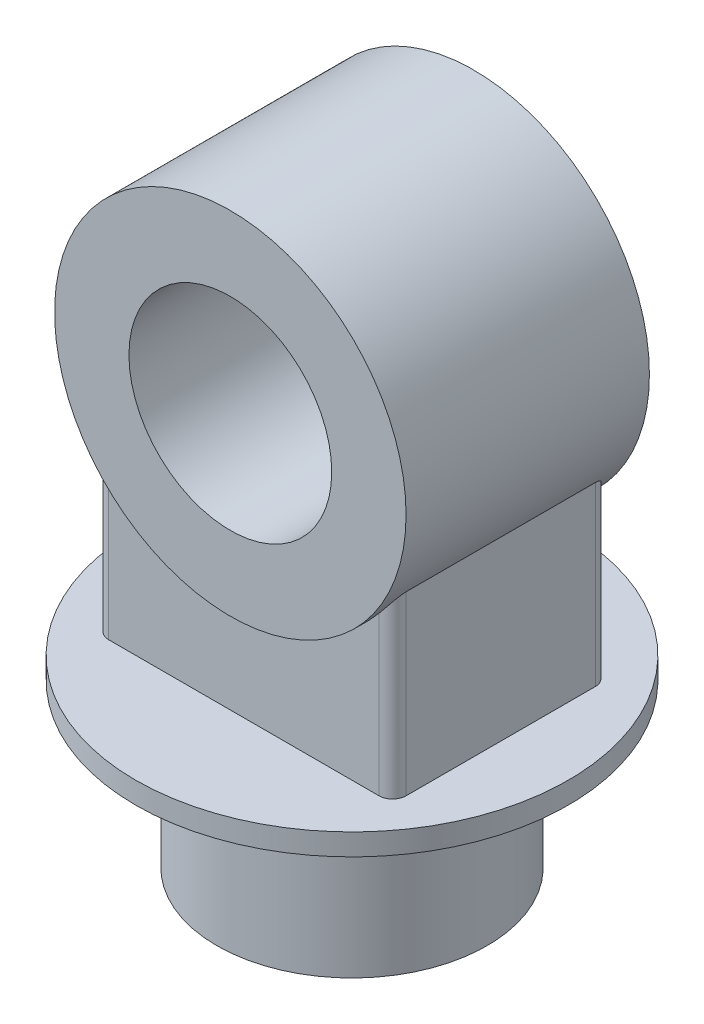
ISO-10303-21;
HEADER;
FILE_DESCRIPTION(('STEP AP214'),'2;1');
FILE_NAME('part.step','',(''),(''),'','','');
FILE_SCHEMA(('AUTOMOTIVE_DESIGN { 1 0 10303 214 1 1 1 1 }'));
ENDSEC;
DATA;
#1=APPLICATION_CONTEXT('core data for automotive mechanical design processes');
#2=APPLICATION_PROTOCOL_DEFINITION('international standard','automotive_design',2000,#1);
#3=PRODUCT_CONTEXT('',#1,'mechanical');
#4=PRODUCT('Part','Part','',(#3));
#5=PRODUCT_RELATED_PRODUCT_CATEGORY('part','',(#4));
#6=PRODUCT_DEFINITION_FORMATION('','',#4);
#7=PRODUCT_DEFINITION_CONTEXT('part definition',#1,'design');
#8=PRODUCT_DEFINITION('design','',#6,#7);
#9=PRODUCT_DEFINITION_SHAPE('','',#8);
#10=(LENGTH_UNIT() NAMED_UNIT(*) SI_UNIT(.MILLI.,.METRE.));
#11=(NAMED_UNIT(*) PLANE_ANGLE_UNIT() SI_UNIT($,.RADIAN.));
#12=(NAMED_UNIT(*) SI_UNIT($,.STERADIAN.) SOLID_ANGLE_UNIT());
#13=UNCERTAINTY_MEASURE_WITH_UNIT(LENGTH_MEASURE(1.E-05),#10,'distance_accuracy_value','');
#14=(GEOMETRIC_REPRESENTATION_CONTEXT(3) GLOBAL_UNCERTAINTY_ASSIGNED_CONTEXT((#13)) GLOBAL_UNIT_ASSIGNED_CONTEXT((#10,
#11,#12)) REPRESENTATION_CONTEXT('',''));
#15=CARTESIAN_POINT('',(0.,0.,0.));
#16=DIRECTION('',(0.,0.,1.));
#17=DIRECTION('',(1.,0.,0.));
#18=AXIS2_PLACEMENT_3D('',#15,#16,#17);
#19=CARTESIAN_POINT('',(0.,120.,0.));
#20=DIRECTION('',(0.,-1.,0.));
#21=DIRECTION('',(0.,0.,-1.));
#22=AXIS2_PLACEMENT_3D('',#19,#20,#21);
#23=CYLINDRICAL_SURFACE('',#22,100.);
#24=CARTESIAN_POINT('',(0.,120.,0.));
#25=DIRECTION('',(0.,1.,0.));
#26=DIRECTION('',(0.,0.,1.));
#27=AXIS2_PLACEMENT_3D('',#24,#25,#26);
#28=CIRCLE('',#27,100.);
#29=CARTESIAN_POINT('',(0.,120.,100.));
#30=VERTEX_POINT('',#29);
#31=EDGE_CURVE('E140',#30,#30,#28,.T.);
#32=ORIENTED_EDGE('',*,*,#31,.F.);
#33=EDGE_LOOP('',(#32));
#34=FACE_BOUND('',#33,.T.);
#35=CARTESIAN_POINT('',(0.,0.,0.));
#36=DIRECTION('',(0.,1.,0.));
#37=DIRECTION('',(0.,0.,1.));
#38=AXIS2_PLACEMENT_3D('',#35,#36,#37);
#39=CIRCLE('',#38,100.);
#40=CARTESIAN_POINT('',(0.,0.,100.));
#41=VERTEX_POINT('',#40);
#42=EDGE_CURVE('E214',#41,#41,#39,.T.);
#43=ORIENTED_EDGE('',*,*,#42,.T.);
#44=EDGE_LOOP('',(#43));
#45=FACE_BOUND('',#44,.T.);
#46=ADVANCED_FACE('F40',(#34,#45),#23,.T.);
#47=CARTESIAN_POINT('',(0.,0.,0.));
#48=DIRECTION('',(0.,1.,0.));
#49=DIRECTION('',(0.,0.,1.));
#50=AXIS2_PLACEMENT_3D('',#47,#48,#49);
#51=PLANE('',#50);
#52=ORIENTED_EDGE('',*,*,#42,.F.);
#53=EDGE_LOOP('',(#52));
#54=FACE_BOUND('',#53,.T.);
#55=ADVANCED_FACE('F223',(#54),#51,.F.);
#56=CARTESIAN_POINT('',(0.,136.,0.));
#57=DIRECTION('',(0.,-1.,0.));
#58=DIRECTION('',(0.,0.,-1.));
#59=AXIS2_PLACEMENT_3D('',#56,#57,#58);
#60=CYLINDRICAL_SURFACE('',#59,160.);
#61=CARTESIAN_POINT('',(0.,136.,0.));
#62=DIRECTION('',(0.,1.,0.));
#63=DIRECTION('',(0.,0.,1.));
#64=AXIS2_PLACEMENT_3D('',#61,#62,#63);
#65=CIRCLE('',#64,160.);
#66=CARTESIAN_POINT('',(0.,136.,160.));
#67=VERTEX_POINT('',#66);
#68=EDGE_CURVE('E211',#67,#67,#65,.T.);
#69=ORIENTED_EDGE('',*,*,#68,.F.);
#70=EDGE_LOOP('',(#69));
#71=FACE_BOUND('',#70,.T.);
#72=CARTESIAN_POINT('',(0.,120.,0.));
#73=DIRECTION('',(0.,1.,0.));
#74=DIRECTION('',(0.,0.,1.));
#75=AXIS2_PLACEMENT_3D('',#72,#73,#74);
#76=CIRCLE('',#75,160.);
#77=CARTESIAN_POINT('',(0.,120.,160.));
#78=VERTEX_POINT('',#77);
#79=EDGE_CURVE('E215',#78,#78,#76,.T.);
#80=ORIENTED_EDGE('',*,*,#79,.T.);
#81=EDGE_LOOP('',(#80));
#82=FACE_BOUND('',#81,.T.);
#83=ADVANCED_FACE('F225',(#71,#82),#60,.T.);
#84=CARTESIAN_POINT('',(0.,136.,0.));
#85=DIRECTION('',(0.,1.,0.));
#86=DIRECTION('',(0.,0.,1.));
#87=AXIS2_PLACEMENT_3D('',#84,#85,#86);
#88=PLANE('',#87);
#89=DIRECTION('',(0.,0.,-1.));
#90=VECTOR('',#89,1.);
#91=CARTESIAN_POINT('',(110.,136.,-80.));
#92=LINE('',#91,#90);
#93=CARTESIAN_POINT('',(110.,136.,70.));
#94=VERTEX_POINT('',#93);
#95=CARTESIAN_POINT('',(110.,136.,-70.));
#96=VERTEX_POINT('',#95);
#97=EDGE_CURVE('E191',#94,#96,#92,.T.);
#98=ORIENTED_EDGE('',*,*,#97,.F.);
#99=CARTESIAN_POINT('',(100.,136.,70.));
#100=DIRECTION('',(0.,1.,0.));
#101=DIRECTION('',(0.,0.,1.));
#102=AXIS2_PLACEMENT_3D('',#99,#100,#101);
#103=CIRCLE('',#102,10.);
#104=CARTESIAN_POINT('',(100.,136.,80.));
#105=VERTEX_POINT('',#104);
#106=EDGE_CURVE('E54',#94,#105,#103,.F.);
#107=ORIENTED_EDGE('',*,*,#106,.T.);
#108=DIRECTION('',(1.,0.,0.));
#109=VECTOR('',#108,1.);
#110=CARTESIAN_POINT('',(-110.,136.,80.));
#111=LINE('',#110,#109);
#112=CARTESIAN_POINT('',(-100.,136.,80.));
#113=VERTEX_POINT('',#112);
#114=EDGE_CURVE('E190',#113,#105,#111,.T.);
#115=ORIENTED_EDGE('',*,*,#114,.F.);
#116=CARTESIAN_POINT('',(-100.,136.,70.));
#117=DIRECTION('',(0.,1.,0.));
#118=DIRECTION('',(0.,0.,1.));
#119=AXIS2_PLACEMENT_3D('',#116,#117,#118);
#120=CIRCLE('',#119,10.);
#121=CARTESIAN_POINT('',(-110.,136.,70.));
#122=VERTEX_POINT('',#121);
#123=EDGE_CURVE('E123',#113,#122,#120,.F.);
#124=ORIENTED_EDGE('',*,*,#123,.T.);
#125=DIRECTION('',(0.,0.,1.));
#126=VECTOR('',#125,1.);
#127=CARTESIAN_POINT('',(-110.,136.,-80.));
#128=LINE('',#127,#126);
#129=CARTESIAN_POINT('',(-110.,136.,-70.));
#130=VERTEX_POINT('',#129);
#131=EDGE_CURVE('E192',#130,#122,#128,.T.);
#132=ORIENTED_EDGE('',*,*,#131,.F.);
#133=CARTESIAN_POINT('',(-100.,136.,-70.));
#134=DIRECTION('',(0.,1.,0.));
#135=DIRECTION('',(0.,0.,1.));
#136=AXIS2_PLACEMENT_3D('',#133,#134,#135);
#137=CIRCLE('',#136,10.);
#138=CARTESIAN_POINT('',(-100.,136.,-80.));
#139=VERTEX_POINT('',#138);
#140=EDGE_CURVE('E122',#130,#139,#137,.F.);
#141=ORIENTED_EDGE('',*,*,#140,.T.);
#142=DIRECTION('',(-1.,0.,0.));
#143=VECTOR('',#142,1.);
#144=CARTESIAN_POINT('',(-110.,136.,-80.));
#145=LINE('',#144,#143);
#146=CARTESIAN_POINT('',(100.,136.,-80.));
#147=VERTEX_POINT('',#146);
#148=EDGE_CURVE('E201',#147,#139,#145,.T.);
#149=ORIENTED_EDGE('',*,*,#148,.F.);
#150=CARTESIAN_POINT('',(100.,136.,-70.));
#151=DIRECTION('',(0.,1.,0.));
#152=DIRECTION('',(0.,0.,1.));
#153=AXIS2_PLACEMENT_3D('',#150,#151,#152);
#154=CIRCLE('',#153,10.);
#155=EDGE_CURVE('E61',#147,#96,#154,.F.);
#156=ORIENTED_EDGE('',*,*,#155,.T.);
#157=EDGE_LOOP('',(#98,#107,#115,#124,#132,#141,#149,#156));
#158=FACE_BOUND('',#157,.T.);
#159=ORIENTED_EDGE('',*,*,#68,.T.);
#160=EDGE_LOOP('',(#159));
#161=FACE_BOUND('',#160,.T.);
#162=ADVANCED_FACE('F188',(#158,#161),#88,.T.);
#163=CARTESIAN_POINT('',(0.,120.,0.));
#164=DIRECTION('',(0.,1.,0.));
#165=DIRECTION('',(0.,0.,1.));
#166=AXIS2_PLACEMENT_3D('',#163,#164,#165);
#167=PLANE('',#166);
#168=ORIENTED_EDGE('',*,*,#31,.T.);
#169=EDGE_LOOP('',(#168));
#170=FACE_BOUND('',#169,.T.);
#171=ORIENTED_EDGE('',*,*,#79,.F.);
#172=EDGE_LOOP('',(#171));
#173=FACE_BOUND('',#172,.T.);
#174=ADVANCED_FACE('F234',(#170,#173),#167,.F.);
#175=CARTESIAN_POINT('',(-110.,466.002,-80.));
#176=DIRECTION('',(0.,0.,1.));
#177=DIRECTION('',(1.,0.,0.));
#178=AXIS2_PLACEMENT_3D('',#175,#176,#177);
#179=PLANE('',#178);
#180=ORIENTED_EDGE('',*,*,#148,.T.);
#181=DIRECTION('',(0.,-1.,0.));
#182=VECTOR('',#181,1.);
#183=CARTESIAN_POINT('',(-100.,466.002,-80.));
#184=LINE('',#183,#182);
#185=CARTESIAN_POINT('',(-100.,252.933761370819,-80.));
#186=VERTEX_POINT('',#185);
#187=EDGE_CURVE('E148',#139,#186,#184,.F.);
#188=ORIENTED_EDGE('',*,*,#187,.T.);
#189=CARTESIAN_POINT('',(0.,336.,-80.));
#190=DIRECTION('',(0.,0.,1.));
#191=DIRECTION('',(1.,0.,0.));
#192=AXIS2_PLACEMENT_3D('',#189,#190,#191);
#193=CIRCLE('',#192,130.);
#194=CARTESIAN_POINT('',(100.,252.933761370819,-80.));
#195=VERTEX_POINT('',#194);
#196=EDGE_CURVE('E202',#195,#186,#193,.F.);
#197=ORIENTED_EDGE('',*,*,#196,.F.);
#198=DIRECTION('',(0.,-1.,0.));
#199=VECTOR('',#198,1.);
#200=CARTESIAN_POINT('',(100.,466.002,-80.));
#201=LINE('',#200,#199);
#202=EDGE_CURVE('E145',#195,#147,#201,.T.);
#203=ORIENTED_EDGE('',*,*,#202,.T.);
#204=EDGE_LOOP('',(#180,#188,#197,#203));
#205=FACE_BOUND('',#204,.T.);
#206=ADVANCED_FACE('F237',(#205),#179,.F.);
#207=CARTESIAN_POINT('',(110.,466.002,-80.));
#208=DIRECTION('',(-1.,0.,0.));
#209=DIRECTION('',(0.,0.,1.));
#210=AXIS2_PLACEMENT_3D('',#207,#208,#209);
#211=PLANE('',#210);
#212=ORIENTED_EDGE('',*,*,#97,.T.);
#213=DIRECTION('',(0.,-1.,0.));
#214=VECTOR('',#213,1.);
#215=CARTESIAN_POINT('',(110.,466.002,-70.));
#216=LINE('',#215,#214);
#217=CARTESIAN_POINT('',(110.,266.717967697245,-69.9999999999999));
#218=VERTEX_POINT('',#217);
#219=EDGE_CURVE('E152',#96,#218,#216,.F.);
#220=ORIENTED_EDGE('',*,*,#219,.T.);
#221=DIRECTION('',(0.,0.,-1.));
#222=VECTOR('',#221,1.);
#223=CARTESIAN_POINT('',(110.,266.717967697245,90.));
#224=LINE('',#223,#222);
#225=CARTESIAN_POINT('',(110.,266.717967697245,70.));
#226=VERTEX_POINT('',#225);
#227=EDGE_CURVE('E196',#226,#218,#224,.T.);
#228=ORIENTED_EDGE('',*,*,#227,.F.);
#229=DIRECTION('',(0.,-1.,0.));
#230=VECTOR('',#229,1.);
#231=CARTESIAN_POINT('',(110.,466.002,70.));
#232=LINE('',#231,#230);
#233=EDGE_CURVE('E150',#226,#94,#232,.T.);
#234=ORIENTED_EDGE('',*,*,#233,.T.);
#235=EDGE_LOOP('',(#212,#220,#228,#234));
#236=FACE_BOUND('',#235,.T.);
#237=ADVANCED_FACE('F199',(#236),#211,.F.);
#238=CARTESIAN_POINT('',(-110.,466.002,-80.));
#239=DIRECTION('',(1.,0.,0.));
#240=DIRECTION('',(0.,0.,-1.));
#241=AXIS2_PLACEMENT_3D('',#238,#239,#240);
#242=PLANE('',#241);
#243=ORIENTED_EDGE('',*,*,#131,.T.);
#244=DIRECTION('',(0.,-1.,0.));
#245=VECTOR('',#244,1.);
#246=CARTESIAN_POINT('',(-110.,466.002,70.));
#247=LINE('',#246,#245);
#248=CARTESIAN_POINT('',(-110.,266.717967697245,70.));
#249=VERTEX_POINT('',#248);
#250=EDGE_CURVE('E138',#122,#249,#247,.F.);
#251=ORIENTED_EDGE('',*,*,#250,.T.);
#252=DIRECTION('',(0.,0.,-1.));
#253=VECTOR('',#252,1.);
#254=CARTESIAN_POINT('',(-110.,266.717967697245,90.));
#255=LINE('',#254,#253);
#256=CARTESIAN_POINT('',(-110.,266.717967697245,-69.9999999999999));
#257=VERTEX_POINT('',#256);
#258=EDGE_CURVE('E118',#257,#249,#255,.F.);
#259=ORIENTED_EDGE('',*,*,#258,.F.);
#260=DIRECTION('',(0.,-1.,0.));
#261=VECTOR('',#260,1.);
#262=CARTESIAN_POINT('',(-110.,466.002,-70.));
#263=LINE('',#262,#261);
#264=EDGE_CURVE('E135',#257,#130,#263,.T.);
#265=ORIENTED_EDGE('',*,*,#264,.T.);
#266=EDGE_LOOP('',(#243,#251,#259,#265));
#267=FACE_BOUND('',#266,.T.);
#268=ADVANCED_FACE('F243',(#267),#242,.F.);
#269=CARTESIAN_POINT('',(-110.,466.002,80.));
#270=DIRECTION('',(0.,0.,-1.));
#271=DIRECTION('',(-1.,0.,0.));
#272=AXIS2_PLACEMENT_3D('',#269,#270,#271);
#273=PLANE('',#272);
#274=CARTESIAN_POINT('',(0.,336.,80.));
#275=DIRECTION('',(0.,0.,-1.));
#276=DIRECTION('',(-1.,0.,0.));
#277=AXIS2_PLACEMENT_3D('',#274,#275,#276);
#278=CIRCLE('',#277,130.);
#279=CARTESIAN_POINT('',(-100.,252.933761370819,80.));
#280=VERTEX_POINT('',#279);
#281=CARTESIAN_POINT('',(100.,252.933761370819,80.));
#282=VERTEX_POINT('',#281);
#283=EDGE_CURVE('E115',#280,#282,#278,.F.);
#284=ORIENTED_EDGE('',*,*,#283,.F.);
#285=DIRECTION('',(0.,-1.,0.));
#286=VECTOR('',#285,1.);
#287=CARTESIAN_POINT('',(-100.,466.002,80.));
#288=LINE('',#287,#286);
#289=EDGE_CURVE('E129',#280,#113,#288,.T.);
#290=ORIENTED_EDGE('',*,*,#289,.T.);
#291=ORIENTED_EDGE('',*,*,#114,.T.);
#292=DIRECTION('',(0.,-1.,0.));
#293=VECTOR('',#292,1.);
#294=CARTESIAN_POINT('',(100.,466.002,80.));
#295=LINE('',#294,#293);
#296=EDGE_CURVE('E131',#105,#282,#295,.F.);
#297=ORIENTED_EDGE('',*,*,#296,.T.);
#298=EDGE_LOOP('',(#284,#290,#291,#297));
#299=FACE_BOUND('',#298,.T.);
#300=ADVANCED_FACE('F127',(#299),#273,.F.);
#301=CARTESIAN_POINT('',(0.,336.,90.));
#302=DIRECTION('',(0.,0.,-1.));
#303=DIRECTION('',(-1.,0.,0.));
#304=AXIS2_PLACEMENT_3D('',#301,#302,#303);
#305=CYLINDRICAL_SURFACE('',#304,130.);
#306=CARTESIAN_POINT('',(0.,336.,90.));
#307=DIRECTION('',(0.,0.,1.));
#308=DIRECTION('',(1.,0.,0.));
#309=AXIS2_PLACEMENT_3D('',#306,#307,#308);
#310=CIRCLE('',#309,130.);
#311=CARTESIAN_POINT('',(130.,336.,90.));
#312=VERTEX_POINT('',#311);
#313=EDGE_CURVE('E132',#312,#312,#310,.T.);
#314=ORIENTED_EDGE('',*,*,#313,.F.);
#315=EDGE_LOOP('',(#314));
#316=FACE_BOUND('',#315,.T.);
#317=CARTESIAN_POINT('',(0.,336.,-90.));
#318=DIRECTION('',(0.,0.,1.));
#319=DIRECTION('',(1.,0.,0.));
#320=AXIS2_PLACEMENT_3D('',#317,#318,#319);
#321=CIRCLE('',#320,130.);
#322=CARTESIAN_POINT('',(130.,336.,-90.));
#323=VERTEX_POINT('',#322);
#324=EDGE_CURVE('E261',#323,#323,#321,.T.);
#325=ORIENTED_EDGE('',*,*,#324,.T.);
#326=EDGE_LOOP('',(#325));
#327=FACE_BOUND('',#326,.T.);
#328=ORIENTED_EDGE('',*,*,#283,.T.);
#329=CARTESIAN_POINT('',(100.,252.933761370819,80.));
#330=CARTESIAN_POINT('',(100.223611151915,253.202952503255,79.9999830665315));
#331=CARTESIAN_POINT('',(100.446118360057,253.473036166024,79.9924995885085));
#332=CARTESIAN_POINT('',(100.888548742496,254.014496760122,79.9629173131463));
#333=CARTESIAN_POINT('',(101.108472043759,254.285873626978,79.9408192370116));
#334=CARTESIAN_POINT('',(101.545586290072,254.829711400373,79.8822979337704));
#335=CARTESIAN_POINT('',(101.76277446753,255.102173087004,79.8458612385232));
#336=CARTESIAN_POINT('',(102.193849033468,255.647413797012,79.7588609087488));
#337=CARTESIAN_POINT('',(102.407735374993,255.920192824843,79.7082970735217));
#338=CARTESIAN_POINT('',(103.048408055095,256.74400885936,79.5343891784366));
#339=CARTESIAN_POINT('',(103.469748368072,257.294974230618,79.3894263280958));
#340=CARTESIAN_POINT('',(104.088382224678,258.117224843771,79.1288060997198));
#341=CARTESIAN_POINT('',(104.292337034927,258.39057162742,79.0347525474725));
#342=CARTESIAN_POINT('',(104.695498702643,258.935304765081,78.8319429710982));
#343=CARTESIAN_POINT('',(104.894706004332,259.206691300842,78.7231883289499));
#344=CARTESIAN_POINT('',(105.336170271764,259.812965668139,78.4620472638272));
#345=CARTESIAN_POINT('',(105.577006541077,260.147108038148,78.3055009036513));
#346=CARTESIAN_POINT('',(106.04966094987,260.809343252621,77.967808626391));
#347=CARTESIAN_POINT('',(106.281479043935,261.137436066616,77.7866625854444));
#348=CARTESIAN_POINT('',(106.734152264033,261.784259610706,77.3986376161628));
#349=CARTESIAN_POINT('',(106.955036134368,262.103013877598,77.1918317878757));
#350=CARTESIAN_POINT('',(107.384708325122,262.728803605627,76.749894392022));
#351=CARTESIAN_POINT('',(107.593501627276,263.035843875289,76.5147746155493));
#352=CARTESIAN_POINT('',(107.921279015409,263.522080966666,76.1068757916446));
#353=CARTESIAN_POINT('',(108.044709884718,263.706240813682,75.9435605188263));
#354=CARTESIAN_POINT('',(108.284949666933,264.066582834907,75.6038296157539));
#355=CARTESIAN_POINT('',(108.401760304956,264.242767084986,75.4274174262629));
#356=CARTESIAN_POINT('',(108.627683741988,264.585236991633,75.0605773993747));
#357=CARTESIAN_POINT('',(108.736797961361,264.751524473746,74.8701521613913));
#358=CARTESIAN_POINT('',(108.945874410432,265.071634412635,74.4745306992528));
#359=CARTESIAN_POINT('',(109.04583974995,265.225461102935,74.2693395369045));
#360=CARTESIAN_POINT('',(109.274660386151,265.579056080623,73.7536743100227));
#361=CARTESIAN_POINT('',(109.398046362816,265.771031349643,73.4351396850742));
#362=CARTESIAN_POINT('',(109.561336457207,266.026263049992,72.9345418523035));
#363=CARTESIAN_POINT('',(109.612072269395,266.105785634321,72.7641622498837));
#364=CARTESIAN_POINT('',(109.705421847597,266.25239837099,72.4160328323223));
#365=CARTESIAN_POINT('',(109.748040656091,266.319496241142,72.2382876769633));
#366=CARTESIAN_POINT('',(109.820262744001,266.433384610412,71.8947331689276));
#367=CARTESIAN_POINT('',(109.850752312767,266.481551609067,71.729567610939));
#368=CARTESIAN_POINT('',(109.903691363628,266.565274678987,71.3948451418076));
#369=CARTESIAN_POINT('',(109.926143541964,266.600834979285,71.2252897238033));
#370=CARTESIAN_POINT('',(109.962659042777,266.658707696818,70.8807814271977));
#371=CARTESIAN_POINT('',(109.976613864032,266.680848750137,70.7057875562757));
#372=CARTESIAN_POINT('',(109.99061964662,266.703076138542,70.4419386674803));
#373=CARTESIAN_POINT('',(109.99413386492,266.708654625171,70.3536902139711));
#374=CARTESIAN_POINT('',(109.998824989492,266.716102079046,70.1769662160103));
#375=CARTESIAN_POINT('',(110.000001659485,266.717970671296,70.0884906495071));
#376=CARTESIAN_POINT('',(110.,266.717967697245,70.));
#377=B_SPLINE_CURVE_WITH_KNOTS('',3,(#329,#330,#331,#332,#333,#334,#335,#336,#337,#338,#339,
#340,#341,#342,#343,#344,#345,#346,#347,#348,#349,#350,#351,#352,#353,#354,#355,#356,#357,#358,
#359,#360,#361,#362,#363,#364,#365,#366,#367,#368,#369,#370,#371,#372,#373,#374,#375,#376),
.UNSPECIFIED.,.F.,.F.,(4,2,2,2,2,2,2,2,2,2,2,2,2,2,2,2,2,2,2,2,2,2,2,4),(0.,1.04974156507776,
2.09943133114567,3.15010942417265,4.20080244462031,6.32356278933861,7.38465211465335,
8.44564176134501,9.76677685539397,11.087918601761,12.4053795382949,13.7222937149077,
14.5479419827463,15.3733741023698,16.1986534888326,17.023651302289,18.194686650492,
18.7783719827905,19.3616935243416,19.8852298594992,20.4085904030381,20.9385006934629,
21.2038887699912,21.4693036704869),.UNSPECIFIED.);
#378=EDGE_CURVE('E11',#282,#226,#377,.T.);
#379=ORIENTED_EDGE('',*,*,#378,.T.);
#380=ORIENTED_EDGE('',*,*,#227,.T.);
#381=CARTESIAN_POINT('',(110.,266.717967697245,-70.));
#382=CARTESIAN_POINT('',(110.000033683462,266.718025852698,-70.1614230595313));
#383=CARTESIAN_POINT('',(109.996092792414,266.711764254296,-70.3228118197691));
#384=CARTESIAN_POINT('',(109.980519982779,266.687045880384,-70.6441123999957));
#385=CARTESIAN_POINT('',(109.968896213713,266.668602027069,-70.8040256031146));
#386=CARTESIAN_POINT('',(109.938376398954,266.620217986395,-71.1196424551221));
#387=CARTESIAN_POINT('',(109.919558261622,266.590400967593,-71.2753727040436));
#388=CARTESIAN_POINT('',(109.875071558334,266.52000006118,-71.5834085562726));
#389=CARTESIAN_POINT('',(109.849400846184,266.479412800404,-71.7357130704249));
#390=CARTESIAN_POINT('',(109.784772267017,266.377386983169,-72.0722520040974));
#391=CARTESIAN_POINT('',(109.744103525393,266.313281105856,-72.2553511890568));
#392=CARTESIAN_POINT('',(109.654040532803,266.17165023193,-72.6141464391851));
#393=CARTESIAN_POINT('',(109.604640075501,266.094115691273,-72.7898371277864));
#394=CARTESIAN_POINT('',(109.497968805892,265.927147418338,-73.133872391345));
#395=CARTESIAN_POINT('',(109.440667457039,265.837667562915,-73.302184951541));
#396=CARTESIAN_POINT('',(109.319341126161,265.648779195145,-73.6304969218558));
#397=CARTESIAN_POINT('',(109.25531768694,265.549372961282,-73.7904982269664));
#398=CARTESIAN_POINT('',(109.085069343255,265.28590129292,-74.1868876463209));
#399=CARTESIAN_POINT('',(108.974781990569,265.115997241409,-74.4176642111939));
#400=CARTESIAN_POINT('',(108.742772943656,264.76058359918,-74.8607110351426));
#401=CARTESIAN_POINT('',(108.621044869784,264.575065307649,-75.072970840064));
#402=CARTESIAN_POINT('',(108.36794946479,264.19164129378,-75.4804206329534));
#403=CARTESIAN_POINT('',(108.236568322626,263.993717884812,-75.6755852518652));
#404=CARTESIAN_POINT('',(107.965814499919,263.588382733387,-76.0497203250661));
#405=CARTESIAN_POINT('',(107.826442440892,263.380971729107,-76.2286920360201));
#406=CARTESIAN_POINT('',(107.56145650763,262.989174407744,-76.5468161797372));
#407=CARTESIAN_POINT('',(107.436764821801,262.805791987749,-76.6879854690673));
#408=CARTESIAN_POINT('',(107.182869679799,262.434497987953,-76.9599552926783));
#409=CARTESIAN_POINT('',(107.053665586411,262.24658576965,-77.0907543539385));
#410=CARTESIAN_POINT('',(106.659844344167,261.677121003612,-77.4685356621901));
#411=CARTESIAN_POINT('',(106.389102445143,261.289965080353,-77.700802481696));
#412=CARTESIAN_POINT('',(105.833418194947,260.504836154638,-78.1298636316309));
#413=CARTESIAN_POINT('',(105.548442441802,260.106838810795,-78.3265689888295));
#414=CARTESIAN_POINT('',(104.96676628824,259.304344779382,-78.6860846955171));
#415=CARTESIAN_POINT('',(104.670068038633,258.899849292081,-78.8489012287857));
#416=CARTESIAN_POINT('',(104.024574509401,258.030646711215,-79.1623550419401));
#417=CARTESIAN_POINT('',(103.674248758637,257.565348460988,-79.3081944572228));
#418=CARTESIAN_POINT('',(102.961876677953,256.632523338709,-79.5587565200929));
#419=CARTESIAN_POINT('',(102.599828734006,256.16499616738,-79.6634734792563));
#420=CARTESIAN_POINT('',(102.051092736822,255.466397204689,-79.7891645729387));
#421=CARTESIAN_POINT('',(101.868137468165,255.235094848973,-79.8257282191264));
#422=CARTESIAN_POINT('',(101.499966150616,254.77288550036,-79.8886289353229));
#423=CARTESIAN_POINT('',(101.314750133026,254.541978502041,-79.9149661467554));
#424=CARTESIAN_POINT('',(100.942320486513,254.080919722901,-79.9572665465167));
#425=CARTESIAN_POINT('',(100.755107350153,253.850767773367,-79.9732322353467));
#426=CARTESIAN_POINT('',(100.378860262163,253.391449185777,-79.9945948234744));
#427=CARTESIAN_POINT('',(100.189826234412,253.162282589497,-79.9999912789888));
#428=CARTESIAN_POINT('',(100.,252.933761370819,-80.));
#429=B_SPLINE_CURVE_WITH_KNOTS('',3,(#381,#382,#383,#384,#385,#386,#387,#388,#389,#390,#391,
#392,#393,#394,#395,#396,#397,#398,#399,#400,#401,#402,#403,#404,#405,#406,#407,#408,#409,#410,
#411,#412,#413,#414,#415,#416,#417,#418,#419,#420,#421,#422,#423,#424,#425,#426,#427,#428),
.UNSPECIFIED.,.F.,.F.,(4,2,2,2,2,2,2,2,2,2,2,2,2,2,2,2,2,2,2,2,2,2,2,4),(0.,0.484045005923085,
0.967577389145422,1.44601544684508,1.92460352520314,2.51835043890464,3.11252108624072,
3.70905613988738,4.30545457926272,5.22516595363368,6.14539326092319,7.06696382284184,
7.98846280401959,8.77680092000532,9.56525081419885,11.1426900482286,12.7240229357796,
14.3050670200468,16.1047501551827,17.9046821508917,18.7960435003637,19.6873925225409,
20.5785265668947,21.4696980275819),.UNSPECIFIED.);
#430=EDGE_CURVE('E183',#218,#195,#429,.T.);
#431=ORIENTED_EDGE('',*,*,#430,.T.);
#432=ORIENTED_EDGE('',*,*,#196,.T.);
#433=CARTESIAN_POINT('',(-100.,252.933761370819,-80.));
#434=CARTESIAN_POINT('',(-100.223611151915,253.202952503255,-79.9999830665315));
#435=CARTESIAN_POINT('',(-100.446118360057,253.473036166024,-79.9924995885084));
#436=CARTESIAN_POINT('',(-100.888548742496,254.014496760122,-79.9629173131463));
#437=CARTESIAN_POINT('',(-101.10847204376,254.285873626978,-79.9408192370115));
#438=CARTESIAN_POINT('',(-101.545586290072,254.829711400373,-79.8822979337703));
#439=CARTESIAN_POINT('',(-101.76277446753,255.102173087004,-79.8458612385231));
#440=CARTESIAN_POINT('',(-102.193849033468,255.647413797012,-79.7588609087488));
#441=CARTESIAN_POINT('',(-102.407735374993,255.920192824843,-79.7082970735217));
#442=CARTESIAN_POINT('',(-103.048408055095,256.74400885936,-79.5343891784366));
#443=CARTESIAN_POINT('',(-103.469748368072,257.294974230618,-79.3894263280957));
#444=CARTESIAN_POINT('',(-104.088382224678,258.117224843771,-79.1288060997197));
#445=CARTESIAN_POINT('',(-104.292337034927,258.39057162742,-79.0347525474724));
#446=CARTESIAN_POINT('',(-104.695498702643,258.935304765081,-78.8319429710982));
#447=CARTESIAN_POINT('',(-104.894706004332,259.206691300842,-78.7231883289499));
#448=CARTESIAN_POINT('',(-105.336170271764,259.812965668139,-78.4620472638272));
#449=CARTESIAN_POINT('',(-105.577006541077,260.147108038148,-78.3055009036513));
#450=CARTESIAN_POINT('',(-106.049660949871,260.809343252621,-77.967808626391));
#451=CARTESIAN_POINT('',(-106.281479043935,261.137436066616,-77.7866625854443));
#452=CARTESIAN_POINT('',(-106.734152264033,261.784259610706,-77.3986376161628));
#453=CARTESIAN_POINT('',(-106.955036134368,262.103013877599,-77.1918317878757));
#454=CARTESIAN_POINT('',(-107.384708325122,262.728803605627,-76.749894392022));
#455=CARTESIAN_POINT('',(-107.593501627276,263.035843875289,-76.5147746155492));
#456=CARTESIAN_POINT('',(-107.921279015409,263.522080966667,-76.1068757916446));
#457=CARTESIAN_POINT('',(-108.044709884718,263.706240813682,-75.9435605188263));
#458=CARTESIAN_POINT('',(-108.284949666933,264.066582834907,-75.6038296157538));
#459=CARTESIAN_POINT('',(-108.401760304956,264.242767084987,-75.4274174262628));
#460=CARTESIAN_POINT('',(-108.627683741988,264.585236991633,-75.0605773993746));
#461=CARTESIAN_POINT('',(-108.736797961361,264.751524473746,-74.8701521613912));
#462=CARTESIAN_POINT('',(-108.945874410432,265.071634412635,-74.4745306992527));
#463=CARTESIAN_POINT('',(-109.04583974995,265.225461102935,-74.2693395369045));
#464=CARTESIAN_POINT('',(-109.274660386151,265.579056080623,-73.7536743100227));
#465=CARTESIAN_POINT('',(-109.398046362816,265.771031349643,-73.4351396850742));
#466=CARTESIAN_POINT('',(-109.561336457207,266.026263049993,-72.9345418523035));
#467=CARTESIAN_POINT('',(-109.612072269395,266.105785634321,-72.7641622498836));
#468=CARTESIAN_POINT('',(-109.705421847597,266.25239837099,-72.4160328323222));
#469=CARTESIAN_POINT('',(-109.748040656091,266.319496241142,-72.2382876769632));
#470=CARTESIAN_POINT('',(-109.820262744001,266.433384610412,-71.8947331689276));
#471=CARTESIAN_POINT('',(-109.850752312767,266.481551609067,-71.729567610939));
#472=CARTESIAN_POINT('',(-109.903691363628,266.565274678988,-71.3948451418076));
#473=CARTESIAN_POINT('',(-109.926143541964,266.600834979285,-71.2252897238033));
#474=CARTESIAN_POINT('',(-109.962659042777,266.658707696818,-70.8807814271977));
#475=CARTESIAN_POINT('',(-109.976613864032,266.680848750137,-70.7057875562757));
#476=CARTESIAN_POINT('',(-109.99061964662,266.703076138542,-70.4419386674803));
#477=CARTESIAN_POINT('',(-109.99413386492,266.708654625172,-70.3536902139711));
#478=CARTESIAN_POINT('',(-109.998824989492,266.716102079046,-70.1769662160102));
#479=CARTESIAN_POINT('',(-110.000001659485,266.717970671296,-70.088490649507));
#480=CARTESIAN_POINT('',(-110.,266.717967697245,-70.));
#481=B_SPLINE_CURVE_WITH_KNOTS('',3,(#433,#434,#435,#436,#437,#438,#439,#440,#441,#442,#443,
#444,#445,#446,#447,#448,#449,#450,#451,#452,#453,#454,#455,#456,#457,#458,#459,#460,#461,#462,
#463,#464,#465,#466,#467,#468,#469,#470,#471,#472,#473,#474,#475,#476,#477,#478,#479,#480),
.UNSPECIFIED.,.F.,.F.,(4,2,2,2,2,2,2,2,2,2,2,2,2,2,2,2,2,2,2,2,2,2,2,4),(0.,1.04974156507777,
2.09943133114573,3.15010942417271,4.20080244462036,6.32356278933865,7.38465211465328,
8.445641761345,9.76677685539396,11.087918601761,12.4053795382949,13.7222937149077,
14.5479419827464,15.3733741023699,16.1986534888326,17.023651302289,18.1946866504921,
18.7783719827906,19.3616935243416,19.8852298594993,20.4085904030381,20.938500693463,
21.2038887699913,21.4693036704869),.UNSPECIFIED.);
#482=EDGE_CURVE('E176',#186,#257,#481,.T.);
#483=ORIENTED_EDGE('',*,*,#482,.T.);
#484=ORIENTED_EDGE('',*,*,#258,.T.);
#485=CARTESIAN_POINT('',(-110.,266.717967697245,70.));
#486=CARTESIAN_POINT('',(-110.000033683462,266.718025852698,70.1614230595313));
#487=CARTESIAN_POINT('',(-109.996092792414,266.711764254296,70.3228118197691));
#488=CARTESIAN_POINT('',(-109.980519982779,266.687045880384,70.6441123999958));
#489=CARTESIAN_POINT('',(-109.968896213713,266.668602027069,70.8040256031146));
#490=CARTESIAN_POINT('',(-109.938376398954,266.620217986395,71.1196424551221));
#491=CARTESIAN_POINT('',(-109.919558261622,266.590400967593,71.2753727040436));
#492=CARTESIAN_POINT('',(-109.875071558334,266.52000006118,71.5834085562726));
#493=CARTESIAN_POINT('',(-109.849400846184,266.479412800404,71.7357130704249));
#494=CARTESIAN_POINT('',(-109.784772267017,266.377386983169,72.0722520040974));
#495=CARTESIAN_POINT('',(-109.744103525393,266.313281105856,72.2553511890568));
#496=CARTESIAN_POINT('',(-109.654040532803,266.17165023193,72.6141464391851));
#497=CARTESIAN_POINT('',(-109.604640075501,266.094115691273,72.7898371277865));
#498=CARTESIAN_POINT('',(-109.497968805892,265.927147418338,73.1338723913451));
#499=CARTESIAN_POINT('',(-109.440667457039,265.837667562915,73.3021849515411));
#500=CARTESIAN_POINT('',(-109.319341126161,265.648779195145,73.6304969218558));
#501=CARTESIAN_POINT('',(-109.25531768694,265.549372961282,73.7904982269664));
#502=CARTESIAN_POINT('',(-109.085069343255,265.28590129292,74.1868876463209));
#503=CARTESIAN_POINT('',(-108.974781990569,265.115997241409,74.4176642111939));
#504=CARTESIAN_POINT('',(-108.742772943656,264.76058359918,74.8607110351427));
#505=CARTESIAN_POINT('',(-108.621044869784,264.575065307649,75.072970840064));
#506=CARTESIAN_POINT('',(-108.36794946479,264.19164129378,75.4804206329535));
#507=CARTESIAN_POINT('',(-108.236568322626,263.993717884812,75.6755852518652));
#508=CARTESIAN_POINT('',(-107.965814499919,263.588382733388,76.0497203250662));
#509=CARTESIAN_POINT('',(-107.826442440892,263.380971729107,76.2286920360201));
#510=CARTESIAN_POINT('',(-107.56145650763,262.989174407744,76.5468161797372));
#511=CARTESIAN_POINT('',(-107.436764821801,262.805791987749,76.6879854690674));
#512=CARTESIAN_POINT('',(-107.182869679799,262.434497987953,76.9599552926783));
#513=CARTESIAN_POINT('',(-107.053665586411,262.24658576965,77.0907543539386));
#514=CARTESIAN_POINT('',(-106.659844344167,261.677121003612,77.4685356621902));
#515=CARTESIAN_POINT('',(-106.389102445143,261.289965080353,77.7008024816961));
#516=CARTESIAN_POINT('',(-105.833418194947,260.504836154638,78.129863631631));
#517=CARTESIAN_POINT('',(-105.548442441802,260.106838810795,78.3265689888296));
#518=CARTESIAN_POINT('',(-104.96676628824,259.304344779382,78.6860846955171));
#519=CARTESIAN_POINT('',(-104.670068038633,258.899849292081,78.8489012287858));
#520=CARTESIAN_POINT('',(-104.024574509401,258.030646711215,79.1623550419402));
#521=CARTESIAN_POINT('',(-103.674248758637,257.565348460988,79.3081944572228));
#522=CARTESIAN_POINT('',(-102.961876677953,256.632523338709,79.558756520093));
#523=CARTESIAN_POINT('',(-102.599828734006,256.16499616738,79.6634734792563));
#524=CARTESIAN_POINT('',(-102.051092736822,255.466397204689,79.7891645729388));
#525=CARTESIAN_POINT('',(-101.868137468165,255.235094848973,79.8257282191265));
#526=CARTESIAN_POINT('',(-101.499966150616,254.77288550036,79.8886289353229));
#527=CARTESIAN_POINT('',(-101.314750133026,254.541978502041,79.9149661467555));
#528=CARTESIAN_POINT('',(-100.942320486513,254.080919722901,79.9572665465168));
#529=CARTESIAN_POINT('',(-100.755107350153,253.850767773367,79.9732322353467));
#530=CARTESIAN_POINT('',(-100.378860262163,253.391449185777,79.9945948234744));
#531=CARTESIAN_POINT('',(-100.189826234412,253.162282589497,79.9999912789888));
#532=CARTESIAN_POINT('',(-100.,252.933761370819,80.));
#533=B_SPLINE_CURVE_WITH_KNOTS('',3,(#485,#486,#487,#488,#489,#490,#491,#492,#493,#494,#495,
#496,#497,#498,#499,#500,#501,#502,#503,#504,#505,#506,#507,#508,#509,#510,#511,#512,#513,#514,
#515,#516,#517,#518,#519,#520,#521,#522,#523,#524,#525,#526,#527,#528,#529,#530,#531,#532),
.UNSPECIFIED.,.F.,.F.,(4,2,2,2,2,2,2,2,2,2,2,2,2,2,2,2,2,2,2,2,2,2,2,4),(0.,0.484045005923086,
0.967577389145422,1.44601544684507,1.92460352520313,2.51835043890468,3.11252108624077,
3.70905613988741,4.30545457926274,5.22516595363374,6.14539326092329,7.06696382284191,
7.98846280401962,8.7768009200054,9.56525081419893,11.1426900482287,12.7240229357797,
14.305067020047,16.1047501551828,17.9046821508918,18.7960435003638,19.6873925225409,
20.5785265668947,21.4696980275819),.UNSPECIFIED.);
#534=EDGE_CURVE('E112',#249,#280,#533,.T.);
#535=ORIENTED_EDGE('',*,*,#534,.T.);
#536=EDGE_LOOP('',(#328,#379,#380,#431,#432,#483,#484,#535));
#537=FACE_BOUND('',#536,.T.);
#538=ADVANCED_FACE('F114',(#316,#327,#537),#305,.T.);
#539=CARTESIAN_POINT('',(0.,336.,90.));
#540=DIRECTION('',(0.,0.,1.));
#541=DIRECTION('',(1.,0.,0.));
#542=AXIS2_PLACEMENT_3D('',#539,#540,#541);
#543=PLANE('',#542);
#544=ORIENTED_EDGE('',*,*,#313,.T.);
#545=EDGE_LOOP('',(#544));
#546=FACE_BOUND('',#545,.T.);
#547=CARTESIAN_POINT('',(0.,336.,90.));
#548=DIRECTION('',(0.,0.,1.));
#549=DIRECTION('',(1.,0.,0.));
#550=AXIS2_PLACEMENT_3D('',#547,#548,#549);
#551=CIRCLE('',#550,75.);
#552=CARTESIAN_POINT('',(-75.,336.,90.));
#553=VERTEX_POINT('',#552);
#554=EDGE_CURVE('E264',#553,#553,#551,.T.);
#555=ORIENTED_EDGE('',*,*,#554,.F.);
#556=EDGE_LOOP('',(#555));
#557=FACE_BOUND('',#556,.T.);
#558=ADVANCED_FACE('F275',(#546,#557),#543,.T.);
#559=CARTESIAN_POINT('',(0.,336.,-90.));
#560=DIRECTION('',(0.,0.,1.));
#561=DIRECTION('',(1.,0.,0.));
#562=AXIS2_PLACEMENT_3D('',#559,#560,#561);
#563=PLANE('',#562);
#564=ORIENTED_EDGE('',*,*,#324,.F.);
#565=EDGE_LOOP('',(#564));
#566=FACE_BOUND('',#565,.T.);
#567=CARTESIAN_POINT('',(0.,336.,-90.));
#568=DIRECTION('',(0.,0.,1.));
#569=DIRECTION('',(1.,0.,0.));
#570=AXIS2_PLACEMENT_3D('',#567,#568,#569);
#571=CIRCLE('',#570,75.);
#572=CARTESIAN_POINT('',(-75.,336.,-90.));
#573=VERTEX_POINT('',#572);
#574=EDGE_CURVE('E267',#573,#573,#571,.T.);
#575=ORIENTED_EDGE('',*,*,#574,.T.);
#576=EDGE_LOOP('',(#575));
#577=FACE_BOUND('',#576,.T.);
#578=ADVANCED_FACE('F277',(#566,#577),#563,.F.);
#579=CARTESIAN_POINT('',(0.,336.,90.));
#580=DIRECTION('',(0.,0.,-1.));
#581=DIRECTION('',(-1.,0.,0.));
#582=AXIS2_PLACEMENT_3D('',#579,#580,#581);
#583=CYLINDRICAL_SURFACE('',#582,75.);
#584=CARTESIAN_POINT('',(-75.,336.,90.));
#585=CARTESIAN_POINT('',(-75.,336.,88.125));
#586=CARTESIAN_POINT('',(-75.,336.,86.25));
#587=CARTESIAN_POINT('',(-75.,336.,82.5));
#588=CARTESIAN_POINT('',(-75.,336.,80.625));
#589=CARTESIAN_POINT('',(-75.,336.,76.875));
#590=CARTESIAN_POINT('',(-75.,336.,75.));
#591=CARTESIAN_POINT('',(-75.,336.,71.25));
#592=CARTESIAN_POINT('',(-75.,336.,69.375));
#593=CARTESIAN_POINT('',(-75.,336.,65.625));
#594=CARTESIAN_POINT('',(-75.,336.,63.75));
#595=CARTESIAN_POINT('',(-75.,336.,60.));
#596=CARTESIAN_POINT('',(-75.,336.,58.125));
#597=CARTESIAN_POINT('',(-75.,336.,54.375));
#598=CARTESIAN_POINT('',(-75.,336.,52.5));
#599=CARTESIAN_POINT('',(-75.,336.,48.75));
#600=CARTESIAN_POINT('',(-75.,336.,46.875));
#601=CARTESIAN_POINT('',(-75.,336.,43.125));
#602=CARTESIAN_POINT('',(-75.,336.,41.25));
#603=CARTESIAN_POINT('',(-75.,336.,37.5));
#604=CARTESIAN_POINT('',(-75.,336.,35.625));
#605=CARTESIAN_POINT('',(-75.,336.,31.875));
#606=CARTESIAN_POINT('',(-75.,336.,30.));
#607=CARTESIAN_POINT('',(-75.,336.,26.25));
#608=CARTESIAN_POINT('',(-75.,336.,24.375));
#609=CARTESIAN_POINT('',(-75.,336.,20.625));
#610=CARTESIAN_POINT('',(-75.,336.,18.75));
#611=CARTESIAN_POINT('',(-75.,336.,15.));
#612=CARTESIAN_POINT('',(-75.,336.,13.125));
#613=CARTESIAN_POINT('',(-75.,336.,9.37499999999998));
#614=CARTESIAN_POINT('',(-75.,336.,7.49999999999998));
#615=CARTESIAN_POINT('',(-75.,336.,3.74999999999998));
#616=CARTESIAN_POINT('',(-75.,336.,1.87499999999997));
#617=CARTESIAN_POINT('',(-75.,336.,-1.87500000000003));
#618=CARTESIAN_POINT('',(-75.,336.,-3.75000000000003));
#619=CARTESIAN_POINT('',(-75.,336.,-7.50000000000003));
#620=CARTESIAN_POINT('',(-75.,336.,-9.37500000000004));
#621=CARTESIAN_POINT('',(-75.,336.,-13.125));
#622=CARTESIAN_POINT('',(-75.,336.,-15.));
#623=CARTESIAN_POINT('',(-75.,336.,-18.75));
#624=CARTESIAN_POINT('',(-75.,336.,-20.625));
#625=CARTESIAN_POINT('',(-75.,336.,-24.375));
#626=CARTESIAN_POINT('',(-75.,336.,-26.25));
#627=CARTESIAN_POINT('',(-75.,336.,-30.));
#628=CARTESIAN_POINT('',(-75.,336.,-31.875));
#629=CARTESIAN_POINT('',(-75.,336.,-35.625));
#630=CARTESIAN_POINT('',(-75.,336.,-37.5));
#631=CARTESIAN_POINT('',(-75.,336.,-41.25));
#632=CARTESIAN_POINT('',(-75.,336.,-43.125));
#633=CARTESIAN_POINT('',(-75.,336.,-46.875));
#634=CARTESIAN_POINT('',(-75.,336.,-48.75));
#635=CARTESIAN_POINT('',(-75.,336.,-52.5));
#636=CARTESIAN_POINT('',(-75.,336.,-54.375));
#637=CARTESIAN_POINT('',(-75.,336.,-58.125));
#638=CARTESIAN_POINT('',(-75.,336.,-60.));
#639=CARTESIAN_POINT('',(-75.,336.,-63.75));
#640=CARTESIAN_POINT('',(-75.,336.,-65.625));
#641=CARTESIAN_POINT('',(-75.,336.,-69.375));
#642=CARTESIAN_POINT('',(-75.,336.,-71.25));
#643=CARTESIAN_POINT('',(-75.,336.,-75.));
#644=CARTESIAN_POINT('',(-75.,336.,-76.875));
#645=CARTESIAN_POINT('',(-75.,336.,-80.625));
#646=CARTESIAN_POINT('',(-75.,336.,-82.5));
#647=CARTESIAN_POINT('',(-75.,336.,-86.25));
#648=CARTESIAN_POINT('',(-75.,336.,-88.125));
#649=CARTESIAN_POINT('',(-75.,336.,-90.));
#650=B_SPLINE_CURVE_WITH_KNOTS('',3,(#584,#585,#586,#587,#588,#589,#590,#591,#592,#593,#594,
#595,#596,#597,#598,#599,#600,#601,#602,#603,#604,#605,#606,#607,#608,#609,#610,#611,#612,#613,
#614,#615,#616,#617,#618,#619,#620,#621,#622,#623,#624,#625,#626,#627,#628,#629,#630,#631,#632,
#633,#634,#635,#636,#637,#638,#639,#640,#641,#642,#643,#644,#645,#646,#647,#648,#649),
.UNSPECIFIED.,.F.,.F.,(4,2,2,2,2,2,2,2,2,2,2,2,2,2,2,2,2,2,2,2,2,2,2,2,2,2,2,2,2,2,2,2,4),(0.,
5.62499999999999,11.25,16.875,22.5,28.125,33.75,39.375,45.,50.625,56.25,61.875,67.5,73.125,
78.75,84.375,90.,95.625,101.25,106.875,112.5,118.125,123.75,129.375,135.,140.625,146.25,151.875,
157.5,163.125,168.75,174.375,180.),.UNSPECIFIED.);
#651=EDGE_CURVE('BSEAM169',#553,#573,#650,.T.);
#652=ORIENTED_EDGE('',*,*,#554,.T.);
#653=ORIENTED_EDGE('',*,*,#574,.F.);
#654=ORIENTED_EDGE('',*,*,#651,.T.);
#655=ORIENTED_EDGE('',*,*,#651,.F.);
#656=EDGE_LOOP('',(#652,#654,#653,#655));
#657=FACE_BOUND('',#656,.T.);
#658=ADVANCED_FACE('F169',(#657),#583,.F.);
#659=CARTESIAN_POINT('',(-100.,466.002,70.));
#660=DIRECTION('',(0.,-1.,0.));
#661=DIRECTION('',(0.,0.,-1.));
#662=AXIS2_PLACEMENT_3D('',#659,#660,#661);
#663=CYLINDRICAL_SURFACE('',#662,10.);
#664=ORIENTED_EDGE('',*,*,#534,.F.);
#665=ORIENTED_EDGE('',*,*,#250,.F.);
#666=ORIENTED_EDGE('',*,*,#123,.F.);
#667=ORIENTED_EDGE('',*,*,#289,.F.);
#668=EDGE_LOOP('',(#664,#665,#666,#667));
#669=FACE_BOUND('',#668,.T.);
#670=ADVANCED_FACE('F134',(#669),#663,.T.);
#671=CARTESIAN_POINT('',(-100.,466.002,-70.));
#672=DIRECTION('',(0.,-1.,0.));
#673=DIRECTION('',(0.,0.,-1.));
#674=AXIS2_PLACEMENT_3D('',#671,#672,#673);
#675=CYLINDRICAL_SURFACE('',#674,10.);
#676=ORIENTED_EDGE('',*,*,#482,.F.);
#677=ORIENTED_EDGE('',*,*,#187,.F.);
#678=ORIENTED_EDGE('',*,*,#140,.F.);
#679=ORIENTED_EDGE('',*,*,#264,.F.);
#680=EDGE_LOOP('',(#676,#677,#678,#679));
#681=FACE_BOUND('',#680,.T.);
#682=ADVANCED_FACE('F168',(#681),#675,.T.);
#683=CARTESIAN_POINT('',(100.,466.002,-70.));
#684=DIRECTION('',(0.,-1.,0.));
#685=DIRECTION('',(0.,0.,-1.));
#686=AXIS2_PLACEMENT_3D('',#683,#684,#685);
#687=CYLINDRICAL_SURFACE('',#686,10.);
#688=ORIENTED_EDGE('',*,*,#430,.F.);
#689=ORIENTED_EDGE('',*,*,#219,.F.);
#690=ORIENTED_EDGE('',*,*,#155,.F.);
#691=ORIENTED_EDGE('',*,*,#202,.F.);
#692=EDGE_LOOP('',(#688,#689,#690,#691));
#693=FACE_BOUND('',#692,.T.);
#694=ADVANCED_FACE('F173',(#693),#687,.T.);
#695=CARTESIAN_POINT('',(100.,466.002,70.));
#696=DIRECTION('',(0.,-1.,0.));
#697=DIRECTION('',(0.,0.,-1.));
#698=AXIS2_PLACEMENT_3D('',#695,#696,#697);
#699=CYLINDRICAL_SURFACE('',#698,10.);
#700=ORIENTED_EDGE('',*,*,#378,.F.);
#701=ORIENTED_EDGE('',*,*,#296,.F.);
#702=ORIENTED_EDGE('',*,*,#106,.F.);
#703=ORIENTED_EDGE('',*,*,#233,.F.);
#704=EDGE_LOOP('',(#700,#701,#702,#703));
#705=FACE_BOUND('',#704,.T.);
#706=ADVANCED_FACE('F42',(#705),#699,.T.);
#707=CLOSED_SHELL('',(#46,#55,#83,#162,#174,#206,#237,#268,#300,#538,#558,#578,#658,#670,#682,
#694,#706));
#708=MANIFOLD_SOLID_BREP('B2',#707);
#709=ADVANCED_BREP_SHAPE_REPRESENTATION('',(#18,#708),#14);
#710=SHAPE_DEFINITION_REPRESENTATION(#9,#709);
ENDSEC;
END-ISO-10303-21;
